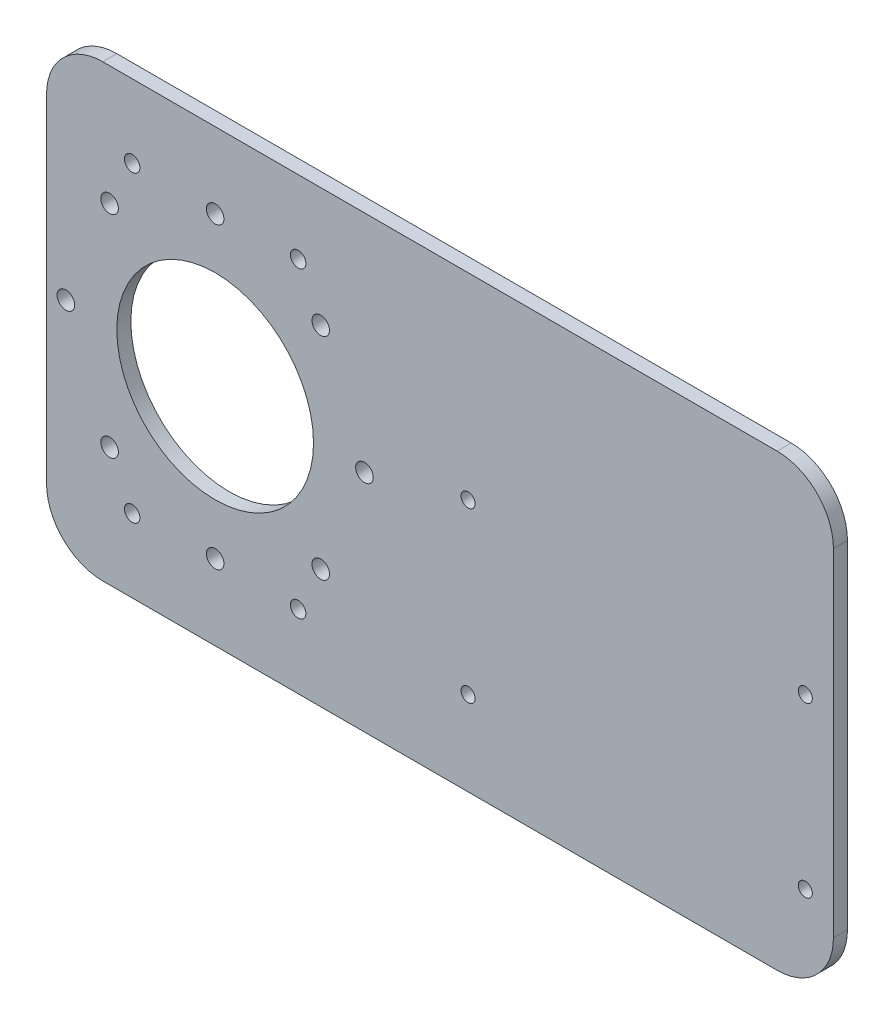
ISO-10303-21;
HEADER;
FILE_DESCRIPTION(('STEP AP214'),'2;1');
FILE_NAME('part.step','',(''),(''),'','','');
FILE_SCHEMA(('AUTOMOTIVE_DESIGN { 1 0 10303 214 1 1 1 1 }'));
ENDSEC;
DATA;
#1=APPLICATION_CONTEXT('core data for automotive mechanical design processes');
#2=APPLICATION_PROTOCOL_DEFINITION('international standard','automotive_design',2000,#1);
#3=PRODUCT_CONTEXT('',#1,'mechanical');
#4=PRODUCT('Part','Part','',(#3));
#5=PRODUCT_RELATED_PRODUCT_CATEGORY('part','',(#4));
#6=PRODUCT_DEFINITION_FORMATION('','',#4);
#7=PRODUCT_DEFINITION_CONTEXT('part definition',#1,'design');
#8=PRODUCT_DEFINITION('design','',#6,#7);
#9=PRODUCT_DEFINITION_SHAPE('','',#8);
#10=(LENGTH_UNIT() NAMED_UNIT(*) SI_UNIT(.MILLI.,.METRE.));
#11=(NAMED_UNIT(*) PLANE_ANGLE_UNIT() SI_UNIT($,.RADIAN.));
#12=(NAMED_UNIT(*) SI_UNIT($,.STERADIAN.) SOLID_ANGLE_UNIT());
#13=UNCERTAINTY_MEASURE_WITH_UNIT(LENGTH_MEASURE(1.E-05),#10,'distance_accuracy_value','');
#14=(GEOMETRIC_REPRESENTATION_CONTEXT(3) GLOBAL_UNCERTAINTY_ASSIGNED_CONTEXT((#13)) GLOBAL_UNIT_ASSIGNED_CONTEXT((#10,
#11,#12)) REPRESENTATION_CONTEXT('',''));
#15=CARTESIAN_POINT('',(0.,0.,0.));
#16=DIRECTION('',(0.,0.,1.));
#17=DIRECTION('',(1.,0.,0.));
#18=AXIS2_PLACEMENT_3D('',#15,#16,#17);
#19=CARTESIAN_POINT('',(0.,0.,6.35));
#20=DIRECTION('',(1.,0.,0.));
#21=DIRECTION('',(0.,0.,-1.));
#22=AXIS2_PLACEMENT_3D('',#19,#20,#21);
#23=PLANE('',#22);
#24=DIRECTION('',(0.,-1.,0.));
#25=VECTOR('',#24,1.);
#26=CARTESIAN_POINT('',(0.,0.,6.35));
#27=LINE('',#26,#25);
#28=CARTESIAN_POINT('',(0.,177.8,6.35));
#29=VERTEX_POINT('',#28);
#30=CARTESIAN_POINT('',(0.,25.4,6.35));
#31=VERTEX_POINT('',#30);
#32=EDGE_CURVE('E147',#29,#31,#27,.T.);
#33=ORIENTED_EDGE('',*,*,#32,.F.);
#34=DIRECTION('',(0.,0.,-1.));
#35=VECTOR('',#34,1.);
#36=CARTESIAN_POINT('',(0.,177.8,6.35));
#37=LINE('',#36,#35);
#38=CARTESIAN_POINT('',(0.,177.8,0.));
#39=VERTEX_POINT('',#38);
#40=EDGE_CURVE('E132',#29,#39,#37,.T.);
#41=ORIENTED_EDGE('',*,*,#40,.T.);
#42=DIRECTION('',(0.,-1.,0.));
#43=VECTOR('',#42,1.);
#44=CARTESIAN_POINT('',(0.,0.,0.));
#45=LINE('',#44,#43);
#46=CARTESIAN_POINT('',(0.,25.4,0.));
#47=VERTEX_POINT('',#46);
#48=EDGE_CURVE('E144',#39,#47,#45,.T.);
#49=ORIENTED_EDGE('',*,*,#48,.T.);
#50=DIRECTION('',(0.,0.,-1.));
#51=VECTOR('',#50,1.);
#52=CARTESIAN_POINT('',(0.,25.4,6.35));
#53=LINE('',#52,#51);
#54=EDGE_CURVE('E149',#47,#31,#53,.F.);
#55=ORIENTED_EDGE('',*,*,#54,.T.);
#56=EDGE_LOOP('',(#33,#41,#49,#55));
#57=FACE_BOUND('',#56,.T.);
#58=ADVANCED_FACE('F62',(#57),#23,.F.);
#59=CARTESIAN_POINT('',(0.,0.,6.35));
#60=DIRECTION('',(0.,1.,0.));
#61=DIRECTION('',(0.,0.,1.));
#62=AXIS2_PLACEMENT_3D('',#59,#60,#61);
#63=PLANE('',#62);
#64=DIRECTION('',(1.,0.,0.));
#65=VECTOR('',#64,1.);
#66=CARTESIAN_POINT('',(0.,0.,6.35));
#67=LINE('',#66,#65);
#68=CARTESIAN_POINT('',(25.4,0.,6.35));
#69=VERTEX_POINT('',#68);
#70=CARTESIAN_POINT('',(330.2,0.,6.35));
#71=VERTEX_POINT('',#70);
#72=EDGE_CURVE('E217',#69,#71,#67,.T.);
#73=ORIENTED_EDGE('',*,*,#72,.F.);
#74=DIRECTION('',(0.,0.,-1.));
#75=VECTOR('',#74,1.);
#76=CARTESIAN_POINT('',(25.4,0.,6.35));
#77=LINE('',#76,#75);
#78=CARTESIAN_POINT('',(25.4,0.,0.));
#79=VERTEX_POINT('',#78);
#80=EDGE_CURVE('E210',#69,#79,#77,.T.);
#81=ORIENTED_EDGE('',*,*,#80,.T.);
#82=DIRECTION('',(1.,0.,0.));
#83=VECTOR('',#82,1.);
#84=CARTESIAN_POINT('',(0.,0.,0.));
#85=LINE('',#84,#83);
#86=CARTESIAN_POINT('',(330.2,0.,0.));
#87=VERTEX_POINT('',#86);
#88=EDGE_CURVE('E153',#79,#87,#85,.T.);
#89=ORIENTED_EDGE('',*,*,#88,.T.);
#90=DIRECTION('',(0.,0.,-1.));
#91=VECTOR('',#90,1.);
#92=CARTESIAN_POINT('',(330.2,0.,6.35));
#93=LINE('',#92,#91);
#94=EDGE_CURVE('E208',#87,#71,#93,.F.);
#95=ORIENTED_EDGE('',*,*,#94,.T.);
#96=EDGE_LOOP('',(#73,#81,#89,#95));
#97=FACE_BOUND('',#96,.T.);
#98=ADVANCED_FACE('F215',(#97),#63,.F.);
#99=CARTESIAN_POINT('',(355.6,0.,6.35));
#100=DIRECTION('',(-1.,0.,0.));
#101=DIRECTION('',(0.,0.,1.));
#102=AXIS2_PLACEMENT_3D('',#99,#100,#101);
#103=PLANE('',#102);
#104=DIRECTION('',(0.,1.,0.));
#105=VECTOR('',#104,1.);
#106=CARTESIAN_POINT('',(355.6,0.,6.35));
#107=LINE('',#106,#105);
#108=CARTESIAN_POINT('',(355.6,25.4,6.35));
#109=VERTEX_POINT('',#108);
#110=CARTESIAN_POINT('',(355.6,177.8,6.35));
#111=VERTEX_POINT('',#110);
#112=EDGE_CURVE('E225',#109,#111,#107,.T.);
#113=ORIENTED_EDGE('',*,*,#112,.F.);
#114=DIRECTION('',(0.,0.,-1.));
#115=VECTOR('',#114,1.);
#116=CARTESIAN_POINT('',(355.6,25.4,6.35));
#117=LINE('',#116,#115);
#118=CARTESIAN_POINT('',(355.6,25.4,0.));
#119=VERTEX_POINT('',#118);
#120=EDGE_CURVE('E12',#109,#119,#117,.T.);
#121=ORIENTED_EDGE('',*,*,#120,.T.);
#122=DIRECTION('',(0.,1.,0.));
#123=VECTOR('',#122,1.);
#124=CARTESIAN_POINT('',(355.6,0.,0.));
#125=LINE('',#124,#123);
#126=CARTESIAN_POINT('',(355.6,177.8,0.));
#127=VERTEX_POINT('',#126);
#128=EDGE_CURVE('E157',#119,#127,#125,.T.);
#129=ORIENTED_EDGE('',*,*,#128,.T.);
#130=DIRECTION('',(0.,0.,-1.));
#131=VECTOR('',#130,1.);
#132=CARTESIAN_POINT('',(355.6,177.8,6.35));
#133=LINE('',#132,#131);
#134=EDGE_CURVE('E70',#127,#111,#133,.F.);
#135=ORIENTED_EDGE('',*,*,#134,.T.);
#136=EDGE_LOOP('',(#113,#121,#129,#135));
#137=FACE_BOUND('',#136,.T.);
#138=ADVANCED_FACE('F224',(#137),#103,.F.);
#139=CARTESIAN_POINT('',(0.,203.2,6.35));
#140=DIRECTION('',(0.,-1.,0.));
#141=DIRECTION('',(0.,0.,-1.));
#142=AXIS2_PLACEMENT_3D('',#139,#140,#141);
#143=PLANE('',#142);
#144=DIRECTION('',(-1.,0.,0.));
#145=VECTOR('',#144,1.);
#146=CARTESIAN_POINT('',(0.,203.2,0.));
#147=LINE('',#146,#145);
#148=CARTESIAN_POINT('',(330.2,203.2,0.));
#149=VERTEX_POINT('',#148);
#150=CARTESIAN_POINT('',(25.4,203.2,0.));
#151=VERTEX_POINT('',#150);
#152=EDGE_CURVE('E167',#149,#151,#147,.T.);
#153=ORIENTED_EDGE('',*,*,#152,.T.);
#154=DIRECTION('',(0.,0.,-1.));
#155=VECTOR('',#154,1.);
#156=CARTESIAN_POINT('',(25.4,203.2,6.35));
#157=LINE('',#156,#155);
#158=CARTESIAN_POINT('',(25.4,203.2,6.35));
#159=VERTEX_POINT('',#158);
#160=EDGE_CURVE('E133',#151,#159,#157,.F.);
#161=ORIENTED_EDGE('',*,*,#160,.T.);
#162=DIRECTION('',(-1.,0.,0.));
#163=VECTOR('',#162,1.);
#164=CARTESIAN_POINT('',(0.,203.2,6.35));
#165=LINE('',#164,#163);
#166=CARTESIAN_POINT('',(330.2,203.2,6.35));
#167=VERTEX_POINT('',#166);
#168=EDGE_CURVE('E163',#167,#159,#165,.T.);
#169=ORIENTED_EDGE('',*,*,#168,.F.);
#170=DIRECTION('',(0.,0.,-1.));
#171=VECTOR('',#170,1.);
#172=CARTESIAN_POINT('',(330.2,203.2,6.35));
#173=LINE('',#172,#171);
#174=EDGE_CURVE('E138',#167,#149,#173,.T.);
#175=ORIENTED_EDGE('',*,*,#174,.T.);
#176=EDGE_LOOP('',(#153,#161,#169,#175));
#177=FACE_BOUND('',#176,.T.);
#178=ADVANCED_FACE('F357',(#177),#143,.F.);
#179=CARTESIAN_POINT('',(0.,0.,6.35));
#180=DIRECTION('',(0.,0.,-1.));
#181=DIRECTION('',(-1.,0.,0.));
#182=AXIS2_PLACEMENT_3D('',#179,#180,#181);
#183=PLANE('',#182);
#184=CARTESIAN_POINT('',(342.9,38.1,6.35));
#185=DIRECTION('',(0.,0.,-1.));
#186=DIRECTION('',(1.,0.,0.));
#187=AXIS2_PLACEMENT_3D('',#184,#185,#186);
#188=CIRCLE('',#187,3.17499999999997);
#189=CARTESIAN_POINT('',(346.075,38.1,6.35));
#190=VERTEX_POINT('',#189);
#191=EDGE_CURVE('E291',#190,#190,#188,.T.);
#192=ORIENTED_EDGE('',*,*,#191,.T.);
#193=EDGE_LOOP('',(#192));
#194=FACE_BOUND('',#193,.T.);
#195=CARTESIAN_POINT('',(190.5,38.1,6.35));
#196=DIRECTION('',(0.,0.,-1.));
#197=DIRECTION('',(1.,0.,0.));
#198=AXIS2_PLACEMENT_3D('',#195,#196,#197);
#199=CIRCLE('',#198,3.17500000000003);
#200=CARTESIAN_POINT('',(193.675,38.1,6.35));
#201=VERTEX_POINT('',#200);
#202=EDGE_CURVE('E297',#201,#201,#199,.T.);
#203=ORIENTED_EDGE('',*,*,#202,.T.);
#204=EDGE_LOOP('',(#203));
#205=FACE_BOUND('',#204,.T.);
#206=CARTESIAN_POINT('',(190.5,114.3,6.35));
#207=DIRECTION('',(0.,0.,-1.));
#208=DIRECTION('',(-1.,0.,0.));
#209=AXIS2_PLACEMENT_3D('',#206,#207,#208);
#210=CIRCLE('',#209,3.17500000000003);
#211=CARTESIAN_POINT('',(187.325,114.3,6.35));
#212=VERTEX_POINT('',#211);
#213=EDGE_CURVE('E285',#212,#212,#210,.T.);
#214=ORIENTED_EDGE('',*,*,#213,.T.);
#215=EDGE_LOOP('',(#214));
#216=FACE_BOUND('',#215,.T.);
#217=CARTESIAN_POINT('',(342.9,114.3,6.35));
#218=DIRECTION('',(0.,0.,-1.));
#219=DIRECTION('',(-1.,0.,0.));
#220=AXIS2_PLACEMENT_3D('',#217,#218,#219);
#221=CIRCLE('',#220,3.17499999999997);
#222=CARTESIAN_POINT('',(339.725,114.3,6.35));
#223=VERTEX_POINT('',#222);
#224=EDGE_CURVE('E268',#223,#223,#221,.T.);
#225=ORIENTED_EDGE('',*,*,#224,.T.);
#226=EDGE_LOOP('',(#225));
#227=FACE_BOUND('',#226,.T.);
#228=CARTESIAN_POINT('',(38.69944,33.10001,6.35));
#229=DIRECTION('',(0.,0.,1.));
#230=DIRECTION('',(1.,0.,0.));
#231=AXIS2_PLACEMENT_3D('',#228,#229,#230);
#232=CIRCLE('',#231,3.50012);
#233=CARTESIAN_POINT('',(42.19956,33.10001,6.35));
#234=VERTEX_POINT('',#233);
#235=EDGE_CURVE('E264',#234,#234,#232,.T.);
#236=ORIENTED_EDGE('',*,*,#235,.F.);
#237=EDGE_LOOP('',(#236));
#238=FACE_BOUND('',#237,.T.);
#239=CARTESIAN_POINT('',(113.70056,33.10001,6.35));
#240=DIRECTION('',(0.,0.,1.));
#241=DIRECTION('',(1.,0.,0.));
#242=AXIS2_PLACEMENT_3D('',#239,#240,#241);
#243=CIRCLE('',#242,3.50012000000002);
#244=CARTESIAN_POINT('',(117.20068,33.10001,6.35));
#245=VERTEX_POINT('',#244);
#246=EDGE_CURVE('E271',#245,#245,#243,.T.);
#247=ORIENTED_EDGE('',*,*,#246,.F.);
#248=EDGE_LOOP('',(#247));
#249=FACE_BOUND('',#248,.T.);
#250=CARTESIAN_POINT('',(113.70056,170.09999,6.35));
#251=DIRECTION('',(0.,0.,1.));
#252=DIRECTION('',(1.,0.,0.));
#253=AXIS2_PLACEMENT_3D('',#250,#251,#252);
#254=CIRCLE('',#253,3.50011999999997);
#255=CARTESIAN_POINT('',(117.20068,170.09999,6.35));
#256=VERTEX_POINT('',#255);
#257=EDGE_CURVE('E277',#256,#256,#254,.T.);
#258=ORIENTED_EDGE('',*,*,#257,.F.);
#259=EDGE_LOOP('',(#258));
#260=FACE_BOUND('',#259,.T.);
#261=CARTESIAN_POINT('',(38.69944,170.09999,6.35));
#262=DIRECTION('',(0.,0.,1.));
#263=DIRECTION('',(1.,0.,0.));
#264=AXIS2_PLACEMENT_3D('',#261,#262,#263);
#265=CIRCLE('',#264,3.50012);
#266=CARTESIAN_POINT('',(42.19956,170.09999,6.35));
#267=VERTEX_POINT('',#266);
#268=EDGE_CURVE('E258',#267,#267,#265,.T.);
#269=ORIENTED_EDGE('',*,*,#268,.F.);
#270=EDGE_LOOP('',(#269));
#271=FACE_BOUND('',#270,.T.);
#272=CARTESIAN_POINT('',(143.66875,101.6,6.35));
#273=DIRECTION('',(0.,0.,1.));
#274=DIRECTION('',(1.,0.,0.));
#275=AXIS2_PLACEMENT_3D('',#272,#273,#274);
#276=CIRCLE('',#275,3.96874999999999);
#277=CARTESIAN_POINT('',(147.6375,101.6,6.35));
#278=VERTEX_POINT('',#277);
#279=EDGE_CURVE('E173',#278,#278,#276,.T.);
#280=ORIENTED_EDGE('',*,*,#279,.F.);
#281=EDGE_LOOP('',(#280));
#282=FACE_BOUND('',#281,.T.);
#283=CARTESIAN_POINT('',(76.2000000000007,34.131249999999,6.35));
#284=DIRECTION('',(0.,0.,1.));
#285=DIRECTION('',(1.,0.,0.));
#286=AXIS2_PLACEMENT_3D('',#283,#284,#285);
#287=CIRCLE('',#286,3.96874999999999);
#288=CARTESIAN_POINT('',(80.1687500000007,34.131249999999,6.35));
#289=VERTEX_POINT('',#288);
#290=EDGE_CURVE('E241',#289,#289,#287,.T.);
#291=ORIENTED_EDGE('',*,*,#290,.F.);
#292=EDGE_LOOP('',(#291));
#293=FACE_BOUND('',#292,.T.);
#294=CARTESIAN_POINT('',(28.4923893568198,149.307610643179,6.35));
#295=DIRECTION('',(0.,0.,1.));
#296=DIRECTION('',(1.,0.,0.));
#297=AXIS2_PLACEMENT_3D('',#294,#295,#296);
#298=CIRCLE('',#297,3.96875);
#299=CARTESIAN_POINT('',(32.4611393568198,149.307610643179,6.35));
#300=VERTEX_POINT('',#299);
#301=EDGE_CURVE('E244',#300,#300,#298,.T.);
#302=ORIENTED_EDGE('',*,*,#301,.F.);
#303=EDGE_LOOP('',(#302));
#304=FACE_BOUND('',#303,.T.);
#305=CARTESIAN_POINT('',(76.1999999999997,169.068749999999,6.35));
#306=DIRECTION('',(0.,0.,1.));
#307=DIRECTION('',(1.,0.,0.));
#308=AXIS2_PLACEMENT_3D('',#305,#306,#307);
#309=CIRCLE('',#308,3.96874999999998);
#310=CARTESIAN_POINT('',(80.1687499999997,169.068749999999,6.35));
#311=VERTEX_POINT('',#310);
#312=EDGE_CURVE('E247',#311,#311,#309,.T.);
#313=ORIENTED_EDGE('',*,*,#312,.F.);
#314=EDGE_LOOP('',(#313));
#315=FACE_BOUND('',#314,.T.);
#316=CARTESIAN_POINT('',(123.90761064318,149.307610643179,6.35));
#317=DIRECTION('',(0.,0.,1.));
#318=DIRECTION('',(1.,0.,0.));
#319=AXIS2_PLACEMENT_3D('',#316,#317,#318);
#320=CIRCLE('',#319,3.96875);
#321=CARTESIAN_POINT('',(127.87636064318,149.307610643179,6.35));
#322=VERTEX_POINT('',#321);
#323=EDGE_CURVE('E250',#322,#322,#320,.T.);
#324=ORIENTED_EDGE('',*,*,#323,.F.);
#325=EDGE_LOOP('',(#324));
#326=FACE_BOUND('',#325,.T.);
#327=CARTESIAN_POINT('',(123.907610643181,53.8923893568198,6.35));
#328=DIRECTION('',(0.,0.,1.));
#329=DIRECTION('',(1.,0.,0.));
#330=AXIS2_PLACEMENT_3D('',#327,#328,#329);
#331=CIRCLE('',#330,3.96874999999999);
#332=CARTESIAN_POINT('',(127.876360643181,53.8923893568198,6.35));
#333=VERTEX_POINT('',#332);
#334=EDGE_CURVE('E234',#333,#333,#331,.T.);
#335=ORIENTED_EDGE('',*,*,#334,.F.);
#336=EDGE_LOOP('',(#335));
#337=FACE_BOUND('',#336,.T.);
#338=CARTESIAN_POINT('',(76.2,101.6,6.35));
#339=DIRECTION('',(0.,0.,1.));
#340=DIRECTION('',(1.,0.,0.));
#341=AXIS2_PLACEMENT_3D('',#338,#339,#340);
#342=CIRCLE('',#341,44.45);
#343=CARTESIAN_POINT('',(120.65,101.6,6.35));
#344=VERTEX_POINT('',#343);
#345=EDGE_CURVE('E231',#344,#344,#342,.T.);
#346=ORIENTED_EDGE('',*,*,#345,.F.);
#347=EDGE_LOOP('',(#346));
#348=FACE_BOUND('',#347,.T.);
#349=CARTESIAN_POINT('',(28.4923893568205,53.8923893568186,6.35));
#350=DIRECTION('',(0.,0.,1.));
#351=DIRECTION('',(1.,0.,0.));
#352=AXIS2_PLACEMENT_3D('',#349,#350,#351);
#353=CIRCLE('',#352,3.96874999999999);
#354=CARTESIAN_POINT('',(32.4611393568205,53.8923893568186,6.35));
#355=VERTEX_POINT('',#354);
#356=EDGE_CURVE('E237',#355,#355,#353,.T.);
#357=ORIENTED_EDGE('',*,*,#356,.F.);
#358=EDGE_LOOP('',(#357));
#359=FACE_BOUND('',#358,.T.);
#360=CARTESIAN_POINT('',(8.73124999999997,101.599999999999,6.35));
#361=DIRECTION('',(0.,0.,1.));
#362=DIRECTION('',(1.,0.,0.));
#363=AXIS2_PLACEMENT_3D('',#360,#361,#362);
#364=CIRCLE('',#363,3.96874999999998);
#365=CARTESIAN_POINT('',(12.7,101.599999999999,6.35));
#366=VERTEX_POINT('',#365);
#367=EDGE_CURVE('E238',#366,#366,#364,.T.);
#368=ORIENTED_EDGE('',*,*,#367,.F.);
#369=EDGE_LOOP('',(#368));
#370=FACE_BOUND('',#369,.T.);
#371=ORIENTED_EDGE('',*,*,#168,.T.);
#372=CARTESIAN_POINT('',(25.4,177.8,6.35));
#373=DIRECTION('',(0.,0.,-1.));
#374=DIRECTION('',(-1.,0.,0.));
#375=AXIS2_PLACEMENT_3D('',#372,#373,#374);
#376=CIRCLE('',#375,25.4);
#377=EDGE_CURVE('E206',#159,#29,#376,.F.);
#378=ORIENTED_EDGE('',*,*,#377,.T.);
#379=ORIENTED_EDGE('',*,*,#32,.T.);
#380=CARTESIAN_POINT('',(25.4,25.4,6.35));
#381=DIRECTION('',(0.,0.,-1.));
#382=DIRECTION('',(-1.,0.,0.));
#383=AXIS2_PLACEMENT_3D('',#380,#381,#382);
#384=CIRCLE('',#383,25.4);
#385=EDGE_CURVE('E204',#31,#69,#384,.F.);
#386=ORIENTED_EDGE('',*,*,#385,.T.);
#387=ORIENTED_EDGE('',*,*,#72,.T.);
#388=CARTESIAN_POINT('',(330.2,25.4,6.35));
#389=DIRECTION('',(0.,0.,-1.));
#390=DIRECTION('',(-1.,0.,0.));
#391=AXIS2_PLACEMENT_3D('',#388,#389,#390);
#392=CIRCLE('',#391,25.4);
#393=EDGE_CURVE('E83',#71,#109,#392,.F.);
#394=ORIENTED_EDGE('',*,*,#393,.T.);
#395=ORIENTED_EDGE('',*,*,#112,.T.);
#396=CARTESIAN_POINT('',(330.2,177.8,6.35));
#397=DIRECTION('',(0.,0.,-1.));
#398=DIRECTION('',(-1.,0.,0.));
#399=AXIS2_PLACEMENT_3D('',#396,#397,#398);
#400=CIRCLE('',#399,25.4);
#401=EDGE_CURVE('E201',#111,#167,#400,.F.);
#402=ORIENTED_EDGE('',*,*,#401,.T.);
#403=EDGE_LOOP('',(#371,#378,#379,#386,#387,#394,#395,#402));
#404=FACE_BOUND('',#403,.T.);
#405=ADVANCED_FACE('F306',(#194,#205,#216,#227,#238,#249,#260,#271,#282,#293,#304,#315,#326,
#337,#348,#359,#370,#404),#183,.F.);
#406=CARTESIAN_POINT('',(0.,0.,0.));
#407=DIRECTION('',(0.,0.,-1.));
#408=DIRECTION('',(-1.,0.,0.));
#409=AXIS2_PLACEMENT_3D('',#406,#407,#408);
#410=PLANE('',#409);
#411=CARTESIAN_POINT('',(342.9,38.1,0.));
#412=DIRECTION('',(0.,0.,-1.));
#413=DIRECTION('',(1.,0.,0.));
#414=AXIS2_PLACEMENT_3D('',#411,#412,#413);
#415=CIRCLE('',#414,3.17499999999997);
#416=CARTESIAN_POINT('',(346.075,38.1,0.));
#417=VERTEX_POINT('',#416);
#418=EDGE_CURVE('E288',#417,#417,#415,.T.);
#419=ORIENTED_EDGE('',*,*,#418,.F.);
#420=EDGE_LOOP('',(#419));
#421=FACE_BOUND('',#420,.T.);
#422=CARTESIAN_POINT('',(190.5,38.1,0.));
#423=DIRECTION('',(0.,0.,-1.));
#424=DIRECTION('',(1.,0.,0.));
#425=AXIS2_PLACEMENT_3D('',#422,#423,#424);
#426=CIRCLE('',#425,3.17500000000003);
#427=CARTESIAN_POINT('',(193.675,38.1,0.));
#428=VERTEX_POINT('',#427);
#429=EDGE_CURVE('E294',#428,#428,#426,.T.);
#430=ORIENTED_EDGE('',*,*,#429,.F.);
#431=EDGE_LOOP('',(#430));
#432=FACE_BOUND('',#431,.T.);
#433=CARTESIAN_POINT('',(190.5,114.3,0.));
#434=DIRECTION('',(0.,0.,-1.));
#435=DIRECTION('',(-1.,0.,0.));
#436=AXIS2_PLACEMENT_3D('',#433,#434,#435);
#437=CIRCLE('',#436,3.17500000000003);
#438=CARTESIAN_POINT('',(187.325,114.3,0.));
#439=VERTEX_POINT('',#438);
#440=EDGE_CURVE('E300',#439,#439,#437,.T.);
#441=ORIENTED_EDGE('',*,*,#440,.F.);
#442=EDGE_LOOP('',(#441));
#443=FACE_BOUND('',#442,.T.);
#444=CARTESIAN_POINT('',(342.9,114.3,0.));
#445=DIRECTION('',(0.,0.,-1.));
#446=DIRECTION('',(-1.,0.,0.));
#447=AXIS2_PLACEMENT_3D('',#444,#445,#446);
#448=CIRCLE('',#447,3.17499999999997);
#449=CARTESIAN_POINT('',(339.725,114.3,0.));
#450=VERTEX_POINT('',#449);
#451=EDGE_CURVE('E282',#450,#450,#448,.T.);
#452=ORIENTED_EDGE('',*,*,#451,.F.);
#453=EDGE_LOOP('',(#452));
#454=FACE_BOUND('',#453,.T.);
#455=CARTESIAN_POINT('',(38.69944,33.10001,0.));
#456=DIRECTION('',(0.,0.,1.));
#457=DIRECTION('',(1.,0.,0.));
#458=AXIS2_PLACEMENT_3D('',#455,#456,#457);
#459=CIRCLE('',#458,3.50012);
#460=CARTESIAN_POINT('',(42.19956,33.10001,0.));
#461=VERTEX_POINT('',#460);
#462=EDGE_CURVE('E267',#461,#461,#459,.T.);
#463=ORIENTED_EDGE('',*,*,#462,.T.);
#464=EDGE_LOOP('',(#463));
#465=FACE_BOUND('',#464,.T.);
#466=CARTESIAN_POINT('',(113.70056,33.10001,0.));
#467=DIRECTION('',(0.,0.,1.));
#468=DIRECTION('',(1.,0.,0.));
#469=AXIS2_PLACEMENT_3D('',#466,#467,#468);
#470=CIRCLE('',#469,3.50012000000002);
#471=CARTESIAN_POINT('',(117.20068,33.10001,0.));
#472=VERTEX_POINT('',#471);
#473=EDGE_CURVE('E274',#472,#472,#470,.T.);
#474=ORIENTED_EDGE('',*,*,#473,.T.);
#475=EDGE_LOOP('',(#474));
#476=FACE_BOUND('',#475,.T.);
#477=CARTESIAN_POINT('',(113.70056,170.09999,0.));
#478=DIRECTION('',(0.,0.,1.));
#479=DIRECTION('',(1.,0.,0.));
#480=AXIS2_PLACEMENT_3D('',#477,#478,#479);
#481=CIRCLE('',#480,3.50011999999997);
#482=CARTESIAN_POINT('',(117.20068,170.09999,0.));
#483=VERTEX_POINT('',#482);
#484=EDGE_CURVE('E261',#483,#483,#481,.T.);
#485=ORIENTED_EDGE('',*,*,#484,.T.);
#486=EDGE_LOOP('',(#485));
#487=FACE_BOUND('',#486,.T.);
#488=CARTESIAN_POINT('',(38.69944,170.09999,0.));
#489=DIRECTION('',(0.,0.,1.));
#490=DIRECTION('',(1.,0.,0.));
#491=AXIS2_PLACEMENT_3D('',#488,#489,#490);
#492=CIRCLE('',#491,3.50012);
#493=CARTESIAN_POINT('',(42.19956,170.09999,0.));
#494=VERTEX_POINT('',#493);
#495=EDGE_CURVE('E253',#494,#494,#492,.T.);
#496=ORIENTED_EDGE('',*,*,#495,.T.);
#497=EDGE_LOOP('',(#496));
#498=FACE_BOUND('',#497,.T.);
#499=CARTESIAN_POINT('',(143.66875,101.6,0.));
#500=DIRECTION('',(0.,0.,-1.));
#501=DIRECTION('',(-1.,0.,0.));
#502=AXIS2_PLACEMENT_3D('',#499,#500,#501);
#503=CIRCLE('',#502,3.96874999999999);
#504=CARTESIAN_POINT('',(139.7,101.6,0.));
#505=VERTEX_POINT('',#504);
#506=EDGE_CURVE('E154',#505,#505,#503,.T.);
#507=ORIENTED_EDGE('',*,*,#506,.F.);
#508=EDGE_LOOP('',(#507));
#509=FACE_BOUND('',#508,.T.);
#510=CARTESIAN_POINT('',(76.2000000000007,34.131249999999,0.));
#511=DIRECTION('',(0.,0.,-1.));
#512=DIRECTION('',(-1.,0.,0.));
#513=AXIS2_PLACEMENT_3D('',#510,#511,#512);
#514=CIRCLE('',#513,3.96874999999999);
#515=CARTESIAN_POINT('',(72.2312500000008,34.131249999999,0.));
#516=VERTEX_POINT('',#515);
#517=EDGE_CURVE('E160',#516,#516,#514,.T.);
#518=ORIENTED_EDGE('',*,*,#517,.F.);
#519=EDGE_LOOP('',(#518));
#520=FACE_BOUND('',#519,.T.);
#521=CARTESIAN_POINT('',(28.4923893568198,149.307610643179,0.));
#522=DIRECTION('',(0.,0.,-1.));
#523=DIRECTION('',(-1.,0.,0.));
#524=AXIS2_PLACEMENT_3D('',#521,#522,#523);
#525=CIRCLE('',#524,3.96875);
#526=CARTESIAN_POINT('',(24.5236393568198,149.307610643179,0.));
#527=VERTEX_POINT('',#526);
#528=EDGE_CURVE('E188',#527,#527,#525,.T.);
#529=ORIENTED_EDGE('',*,*,#528,.F.);
#530=EDGE_LOOP('',(#529));
#531=FACE_BOUND('',#530,.T.);
#532=CARTESIAN_POINT('',(76.1999999999997,169.068749999999,0.));
#533=DIRECTION('',(0.,0.,-1.));
#534=DIRECTION('',(-1.,0.,0.));
#535=AXIS2_PLACEMENT_3D('',#532,#533,#534);
#536=CIRCLE('',#535,3.96874999999998);
#537=CARTESIAN_POINT('',(72.2312499999997,169.068749999999,0.));
#538=VERTEX_POINT('',#537);
#539=EDGE_CURVE('E185',#538,#538,#536,.T.);
#540=ORIENTED_EDGE('',*,*,#539,.F.);
#541=EDGE_LOOP('',(#540));
#542=FACE_BOUND('',#541,.T.);
#543=CARTESIAN_POINT('',(123.90761064318,149.307610643179,0.));
#544=DIRECTION('',(0.,0.,-1.));
#545=DIRECTION('',(-1.,0.,0.));
#546=AXIS2_PLACEMENT_3D('',#543,#544,#545);
#547=CIRCLE('',#546,3.96875);
#548=CARTESIAN_POINT('',(119.93886064318,149.307610643179,0.));
#549=VERTEX_POINT('',#548);
#550=EDGE_CURVE('E182',#549,#549,#547,.T.);
#551=ORIENTED_EDGE('',*,*,#550,.F.);
#552=EDGE_LOOP('',(#551));
#553=FACE_BOUND('',#552,.T.);
#554=CARTESIAN_POINT('',(123.907610643181,53.8923893568198,0.));
#555=DIRECTION('',(0.,0.,-1.));
#556=DIRECTION('',(-1.,0.,0.));
#557=AXIS2_PLACEMENT_3D('',#554,#555,#556);
#558=CIRCLE('',#557,3.96874999999999);
#559=CARTESIAN_POINT('',(119.938860643181,53.8923893568198,0.));
#560=VERTEX_POINT('',#559);
#561=EDGE_CURVE('E179',#560,#560,#558,.T.);
#562=ORIENTED_EDGE('',*,*,#561,.F.);
#563=EDGE_LOOP('',(#562));
#564=FACE_BOUND('',#563,.T.);
#565=CARTESIAN_POINT('',(76.2,101.6,0.));
#566=DIRECTION('',(0.,0.,-1.));
#567=DIRECTION('',(-1.,0.,0.));
#568=AXIS2_PLACEMENT_3D('',#565,#566,#567);
#569=CIRCLE('',#568,44.45);
#570=CARTESIAN_POINT('',(31.75,101.6,0.));
#571=VERTEX_POINT('',#570);
#572=EDGE_CURVE('E176',#571,#571,#569,.T.);
#573=ORIENTED_EDGE('',*,*,#572,.F.);
#574=EDGE_LOOP('',(#573));
#575=FACE_BOUND('',#574,.T.);
#576=CARTESIAN_POINT('',(28.4923893568205,53.8923893568186,0.));
#577=DIRECTION('',(0.,0.,-1.));
#578=DIRECTION('',(-1.,0.,0.));
#579=AXIS2_PLACEMENT_3D('',#576,#577,#578);
#580=CIRCLE('',#579,3.96874999999999);
#581=CARTESIAN_POINT('',(24.5236393568205,53.8923893568186,0.));
#582=VERTEX_POINT('',#581);
#583=EDGE_CURVE('E172',#582,#582,#580,.T.);
#584=ORIENTED_EDGE('',*,*,#583,.F.);
#585=EDGE_LOOP('',(#584));
#586=FACE_BOUND('',#585,.T.);
#587=CARTESIAN_POINT('',(8.73124999999997,101.599999999999,0.));
#588=DIRECTION('',(0.,0.,-1.));
#589=DIRECTION('',(-1.,0.,0.));
#590=AXIS2_PLACEMENT_3D('',#587,#588,#589);
#591=CIRCLE('',#590,3.96874999999998);
#592=CARTESIAN_POINT('',(4.76249999999999,101.599999999999,0.));
#593=VERTEX_POINT('',#592);
#594=EDGE_CURVE('E169',#593,#593,#591,.T.);
#595=ORIENTED_EDGE('',*,*,#594,.F.);
#596=EDGE_LOOP('',(#595));
#597=FACE_BOUND('',#596,.T.);
#598=ORIENTED_EDGE('',*,*,#48,.F.);
#599=CARTESIAN_POINT('',(25.4,177.8,0.));
#600=DIRECTION('',(0.,0.,-1.));
#601=DIRECTION('',(-1.,0.,0.));
#602=AXIS2_PLACEMENT_3D('',#599,#600,#601);
#603=CIRCLE('',#602,25.4);
#604=EDGE_CURVE('E128',#39,#151,#603,.T.);
#605=ORIENTED_EDGE('',*,*,#604,.T.);
#606=ORIENTED_EDGE('',*,*,#152,.F.);
#607=CARTESIAN_POINT('',(330.2,177.8,0.));
#608=DIRECTION('',(0.,0.,-1.));
#609=DIRECTION('',(-1.,0.,0.));
#610=AXIS2_PLACEMENT_3D('',#607,#608,#609);
#611=CIRCLE('',#610,25.4);
#612=EDGE_CURVE('E148',#149,#127,#611,.T.);
#613=ORIENTED_EDGE('',*,*,#612,.T.);
#614=ORIENTED_EDGE('',*,*,#128,.F.);
#615=CARTESIAN_POINT('',(330.2,25.4,0.));
#616=DIRECTION('',(0.,0.,-1.));
#617=DIRECTION('',(-1.,0.,0.));
#618=AXIS2_PLACEMENT_3D('',#615,#616,#617);
#619=CIRCLE('',#618,25.4);
#620=EDGE_CURVE('E195',#119,#87,#619,.T.);
#621=ORIENTED_EDGE('',*,*,#620,.T.);
#622=ORIENTED_EDGE('',*,*,#88,.F.);
#623=CARTESIAN_POINT('',(25.4,25.4,0.));
#624=DIRECTION('',(0.,0.,-1.));
#625=DIRECTION('',(-1.,0.,0.));
#626=AXIS2_PLACEMENT_3D('',#623,#624,#625);
#627=CIRCLE('',#626,25.4);
#628=EDGE_CURVE('E139',#79,#47,#627,.T.);
#629=ORIENTED_EDGE('',*,*,#628,.T.);
#630=EDGE_LOOP('',(#598,#605,#606,#613,#614,#621,#622,#629));
#631=FACE_BOUND('',#630,.T.);
#632=ADVANCED_FACE('F151',(#421,#432,#443,#454,#465,#476,#487,#498,#509,#520,#531,#542,#553,
#564,#575,#586,#597,#631),#410,.T.);
#633=CARTESIAN_POINT('',(8.73124999999997,101.599999999999,-69.85));
#634=DIRECTION('',(0.,0.,1.));
#635=DIRECTION('',(1.,0.,0.));
#636=AXIS2_PLACEMENT_3D('',#633,#634,#635);
#637=CYLINDRICAL_SURFACE('',#636,3.96874999999998);
#638=ORIENTED_EDGE('',*,*,#594,.T.);
#639=EDGE_LOOP('',(#638));
#640=FACE_BOUND('',#639,.T.);
#641=ORIENTED_EDGE('',*,*,#367,.T.);
#642=EDGE_LOOP('',(#641));
#643=FACE_BOUND('',#642,.T.);
#644=ADVANCED_FACE('F319',(#640,#643),#637,.F.);
#645=CARTESIAN_POINT('',(28.4923893568205,53.8923893568186,-69.85));
#646=DIRECTION('',(0.,0.,1.));
#647=DIRECTION('',(1.,0.,0.));
#648=AXIS2_PLACEMENT_3D('',#645,#646,#647);
#649=CYLINDRICAL_SURFACE('',#648,3.96874999999999);
#650=ORIENTED_EDGE('',*,*,#583,.T.);
#651=EDGE_LOOP('',(#650));
#652=FACE_BOUND('',#651,.T.);
#653=ORIENTED_EDGE('',*,*,#356,.T.);
#654=EDGE_LOOP('',(#653));
#655=FACE_BOUND('',#654,.T.);
#656=ADVANCED_FACE('F352',(#652,#655),#649,.F.);
#657=CARTESIAN_POINT('',(76.2,101.6,-69.85));
#658=DIRECTION('',(0.,0.,1.));
#659=DIRECTION('',(1.,0.,0.));
#660=AXIS2_PLACEMENT_3D('',#657,#658,#659);
#661=CYLINDRICAL_SURFACE('',#660,44.45);
#662=ORIENTED_EDGE('',*,*,#572,.T.);
#663=EDGE_LOOP('',(#662));
#664=FACE_BOUND('',#663,.T.);
#665=ORIENTED_EDGE('',*,*,#345,.T.);
#666=EDGE_LOOP('',(#665));
#667=FACE_BOUND('',#666,.T.);
#668=ADVANCED_FACE('F486',(#664,#667),#661,.F.);
#669=CARTESIAN_POINT('',(123.907610643181,53.8923893568198,-69.85));
#670=DIRECTION('',(0.,0.,1.));
#671=DIRECTION('',(1.,0.,0.));
#672=AXIS2_PLACEMENT_3D('',#669,#670,#671);
#673=CYLINDRICAL_SURFACE('',#672,3.96874999999999);
#674=ORIENTED_EDGE('',*,*,#561,.T.);
#675=EDGE_LOOP('',(#674));
#676=FACE_BOUND('',#675,.T.);
#677=ORIENTED_EDGE('',*,*,#334,.T.);
#678=EDGE_LOOP('',(#677));
#679=FACE_BOUND('',#678,.T.);
#680=ADVANCED_FACE('F477',(#676,#679),#673,.F.);
#681=CARTESIAN_POINT('',(123.90761064318,149.307610643179,-69.85));
#682=DIRECTION('',(0.,0.,1.));
#683=DIRECTION('',(1.,0.,0.));
#684=AXIS2_PLACEMENT_3D('',#681,#682,#683);
#685=CYLINDRICAL_SURFACE('',#684,3.96875);
#686=ORIENTED_EDGE('',*,*,#550,.T.);
#687=EDGE_LOOP('',(#686));
#688=FACE_BOUND('',#687,.T.);
#689=ORIENTED_EDGE('',*,*,#323,.T.);
#690=EDGE_LOOP('',(#689));
#691=FACE_BOUND('',#690,.T.);
#692=ADVANCED_FACE('F473',(#688,#691),#685,.F.);
#693=CARTESIAN_POINT('',(76.1999999999997,169.068749999999,-69.85));
#694=DIRECTION('',(0.,0.,1.));
#695=DIRECTION('',(1.,0.,0.));
#696=AXIS2_PLACEMENT_3D('',#693,#694,#695);
#697=CYLINDRICAL_SURFACE('',#696,3.96874999999998);
#698=ORIENTED_EDGE('',*,*,#539,.T.);
#699=EDGE_LOOP('',(#698));
#700=FACE_BOUND('',#699,.T.);
#701=ORIENTED_EDGE('',*,*,#312,.T.);
#702=EDGE_LOOP('',(#701));
#703=FACE_BOUND('',#702,.T.);
#704=ADVANCED_FACE('F469',(#700,#703),#697,.F.);
#705=CARTESIAN_POINT('',(28.4923893568198,149.307610643179,-69.85));
#706=DIRECTION('',(0.,0.,1.));
#707=DIRECTION('',(1.,0.,0.));
#708=AXIS2_PLACEMENT_3D('',#705,#706,#707);
#709=CYLINDRICAL_SURFACE('',#708,3.96875);
#710=ORIENTED_EDGE('',*,*,#528,.T.);
#711=EDGE_LOOP('',(#710));
#712=FACE_BOUND('',#711,.T.);
#713=ORIENTED_EDGE('',*,*,#301,.T.);
#714=EDGE_LOOP('',(#713));
#715=FACE_BOUND('',#714,.T.);
#716=ADVANCED_FACE('F472',(#712,#715),#709,.F.);
#717=CARTESIAN_POINT('',(76.2000000000007,34.131249999999,-69.85));
#718=DIRECTION('',(0.,0.,1.));
#719=DIRECTION('',(1.,0.,0.));
#720=AXIS2_PLACEMENT_3D('',#717,#718,#719);
#721=CYLINDRICAL_SURFACE('',#720,3.96874999999999);
#722=ORIENTED_EDGE('',*,*,#517,.T.);
#723=EDGE_LOOP('',(#722));
#724=FACE_BOUND('',#723,.T.);
#725=ORIENTED_EDGE('',*,*,#290,.T.);
#726=EDGE_LOOP('',(#725));
#727=FACE_BOUND('',#726,.T.);
#728=ADVANCED_FACE('F467',(#724,#727),#721,.F.);
#729=CARTESIAN_POINT('',(143.66875,101.6,-69.85));
#730=DIRECTION('',(0.,0.,1.));
#731=DIRECTION('',(1.,0.,0.));
#732=AXIS2_PLACEMENT_3D('',#729,#730,#731);
#733=CYLINDRICAL_SURFACE('',#732,3.96874999999999);
#734=ORIENTED_EDGE('',*,*,#506,.T.);
#735=EDGE_LOOP('',(#734));
#736=FACE_BOUND('',#735,.T.);
#737=ORIENTED_EDGE('',*,*,#279,.T.);
#738=EDGE_LOOP('',(#737));
#739=FACE_BOUND('',#738,.T.);
#740=ADVANCED_FACE('F463',(#736,#739),#733,.F.);
#741=CARTESIAN_POINT('',(38.69944,170.09999,0.));
#742=DIRECTION('',(0.,0.,1.));
#743=DIRECTION('',(1.,0.,0.));
#744=AXIS2_PLACEMENT_3D('',#741,#742,#743);
#745=CYLINDRICAL_SURFACE('',#744,3.50012);
#746=ORIENTED_EDGE('',*,*,#495,.F.);
#747=EDGE_LOOP('',(#746));
#748=FACE_BOUND('',#747,.T.);
#749=ORIENTED_EDGE('',*,*,#268,.T.);
#750=EDGE_LOOP('',(#749));
#751=FACE_BOUND('',#750,.T.);
#752=ADVANCED_FACE('F454',(#748,#751),#745,.F.);
#753=CARTESIAN_POINT('',(113.70056,170.09999,0.));
#754=DIRECTION('',(0.,0.,1.));
#755=DIRECTION('',(1.,0.,0.));
#756=AXIS2_PLACEMENT_3D('',#753,#754,#755);
#757=CYLINDRICAL_SURFACE('',#756,3.50011999999997);
#758=ORIENTED_EDGE('',*,*,#484,.F.);
#759=EDGE_LOOP('',(#758));
#760=FACE_BOUND('',#759,.T.);
#761=ORIENTED_EDGE('',*,*,#257,.T.);
#762=EDGE_LOOP('',(#761));
#763=FACE_BOUND('',#762,.T.);
#764=ADVANCED_FACE('F450',(#760,#763),#757,.F.);
#765=CARTESIAN_POINT('',(113.70056,33.10001,0.));
#766=DIRECTION('',(0.,0.,1.));
#767=DIRECTION('',(1.,0.,0.));
#768=AXIS2_PLACEMENT_3D('',#765,#766,#767);
#769=CYLINDRICAL_SURFACE('',#768,3.50012000000002);
#770=ORIENTED_EDGE('',*,*,#473,.F.);
#771=EDGE_LOOP('',(#770));
#772=FACE_BOUND('',#771,.T.);
#773=ORIENTED_EDGE('',*,*,#246,.T.);
#774=EDGE_LOOP('',(#773));
#775=FACE_BOUND('',#774,.T.);
#776=ADVANCED_FACE('F453',(#772,#775),#769,.F.);
#777=CARTESIAN_POINT('',(38.69944,33.10001,0.));
#778=DIRECTION('',(0.,0.,1.));
#779=DIRECTION('',(1.,0.,0.));
#780=AXIS2_PLACEMENT_3D('',#777,#778,#779);
#781=CYLINDRICAL_SURFACE('',#780,3.50012);
#782=ORIENTED_EDGE('',*,*,#462,.F.);
#783=EDGE_LOOP('',(#782));
#784=FACE_BOUND('',#783,.T.);
#785=ORIENTED_EDGE('',*,*,#235,.T.);
#786=EDGE_LOOP('',(#785));
#787=FACE_BOUND('',#786,.T.);
#788=ADVANCED_FACE('F382',(#784,#787),#781,.F.);
#789=CARTESIAN_POINT('',(25.4,177.8,6.35));
#790=DIRECTION('',(0.,0.,-1.));
#791=DIRECTION('',(-1.,0.,0.));
#792=AXIS2_PLACEMENT_3D('',#789,#790,#791);
#793=CYLINDRICAL_SURFACE('',#792,25.4);
#794=ORIENTED_EDGE('',*,*,#377,.F.);
#795=ORIENTED_EDGE('',*,*,#160,.F.);
#796=ORIENTED_EDGE('',*,*,#604,.F.);
#797=ORIENTED_EDGE('',*,*,#40,.F.);
#798=EDGE_LOOP('',(#794,#795,#796,#797));
#799=FACE_BOUND('',#798,.T.);
#800=ADVANCED_FACE('F131',(#799),#793,.T.);
#801=CARTESIAN_POINT('',(25.4,25.4,6.35));
#802=DIRECTION('',(0.,0.,-1.));
#803=DIRECTION('',(-1.,0.,0.));
#804=AXIS2_PLACEMENT_3D('',#801,#802,#803);
#805=CYLINDRICAL_SURFACE('',#804,25.4);
#806=ORIENTED_EDGE('',*,*,#385,.F.);
#807=ORIENTED_EDGE('',*,*,#54,.F.);
#808=ORIENTED_EDGE('',*,*,#628,.F.);
#809=ORIENTED_EDGE('',*,*,#80,.F.);
#810=EDGE_LOOP('',(#806,#807,#808,#809));
#811=FACE_BOUND('',#810,.T.);
#812=ADVANCED_FACE('F371',(#811),#805,.T.);
#813=CARTESIAN_POINT('',(330.2,25.4,6.35));
#814=DIRECTION('',(0.,0.,-1.));
#815=DIRECTION('',(-1.,0.,0.));
#816=AXIS2_PLACEMENT_3D('',#813,#814,#815);
#817=CYLINDRICAL_SURFACE('',#816,25.4);
#818=ORIENTED_EDGE('',*,*,#393,.F.);
#819=ORIENTED_EDGE('',*,*,#94,.F.);
#820=ORIENTED_EDGE('',*,*,#620,.F.);
#821=ORIENTED_EDGE('',*,*,#120,.F.);
#822=EDGE_LOOP('',(#818,#819,#820,#821));
#823=FACE_BOUND('',#822,.T.);
#824=ADVANCED_FACE('F223',(#823),#817,.T.);
#825=CARTESIAN_POINT('',(330.2,177.8,6.35));
#826=DIRECTION('',(0.,0.,-1.));
#827=DIRECTION('',(-1.,0.,0.));
#828=AXIS2_PLACEMENT_3D('',#825,#826,#827);
#829=CYLINDRICAL_SURFACE('',#828,25.4);
#830=ORIENTED_EDGE('',*,*,#401,.F.);
#831=ORIENTED_EDGE('',*,*,#134,.F.);
#832=ORIENTED_EDGE('',*,*,#612,.F.);
#833=ORIENTED_EDGE('',*,*,#174,.F.);
#834=EDGE_LOOP('',(#830,#831,#832,#833));
#835=FACE_BOUND('',#834,.T.);
#836=ADVANCED_FACE('F64',(#835),#829,.T.);
#837=CARTESIAN_POINT('',(342.9,114.3,6.35));
#838=DIRECTION('',(0.,0.,-1.));
#839=DIRECTION('',(-1.,0.,0.));
#840=AXIS2_PLACEMENT_3D('',#837,#838,#839);
#841=CYLINDRICAL_SURFACE('',#840,3.17499999999997);
#842=ORIENTED_EDGE('',*,*,#224,.F.);
#843=EDGE_LOOP('',(#842));
#844=FACE_BOUND('',#843,.T.);
#845=ORIENTED_EDGE('',*,*,#451,.T.);
#846=EDGE_LOOP('',(#845));
#847=FACE_BOUND('',#846,.T.);
#848=ADVANCED_FACE('F313',(#844,#847),#841,.F.);
#849=CARTESIAN_POINT('',(190.5,114.3,6.35));
#850=DIRECTION('',(0.,0.,-1.));
#851=DIRECTION('',(-1.,0.,0.));
#852=AXIS2_PLACEMENT_3D('',#849,#850,#851);
#853=CYLINDRICAL_SURFACE('',#852,3.17500000000003);
#854=ORIENTED_EDGE('',*,*,#213,.F.);
#855=EDGE_LOOP('',(#854));
#856=FACE_BOUND('',#855,.T.);
#857=ORIENTED_EDGE('',*,*,#440,.T.);
#858=EDGE_LOOP('',(#857));
#859=FACE_BOUND('',#858,.T.);
#860=ADVANCED_FACE('F309',(#856,#859),#853,.F.);
#861=CARTESIAN_POINT('',(190.5,38.1,6.35));
#862=DIRECTION('',(0.,0.,-1.));
#863=DIRECTION('',(-1.,0.,0.));
#864=AXIS2_PLACEMENT_3D('',#861,#862,#863);
#865=CYLINDRICAL_SURFACE('',#864,3.17500000000003);
#866=ORIENTED_EDGE('',*,*,#202,.F.);
#867=EDGE_LOOP('',(#866));
#868=FACE_BOUND('',#867,.T.);
#869=ORIENTED_EDGE('',*,*,#429,.T.);
#870=EDGE_LOOP('',(#869));
#871=FACE_BOUND('',#870,.T.);
#872=ADVANCED_FACE('F312',(#868,#871),#865,.F.);
#873=CARTESIAN_POINT('',(342.9,38.1,6.35));
#874=DIRECTION('',(0.,0.,-1.));
#875=DIRECTION('',(-1.,0.,0.));
#876=AXIS2_PLACEMENT_3D('',#873,#874,#875);
#877=CYLINDRICAL_SURFACE('',#876,3.17499999999997);
#878=ORIENTED_EDGE('',*,*,#191,.F.);
#879=EDGE_LOOP('',(#878));
#880=FACE_BOUND('',#879,.T.);
#881=ORIENTED_EDGE('',*,*,#418,.T.);
#882=EDGE_LOOP('',(#881));
#883=FACE_BOUND('',#882,.T.);
#884=ADVANCED_FACE('F433',(#880,#883),#877,.F.);
#885=CLOSED_SHELL('',(#58,#98,#138,#178,#405,#632,#644,#656,#668,#680,#692,#704,#716,#728,#740,
#752,#764,#776,#788,#800,#812,#824,#836,#848,#860,#872,#884));
#886=MANIFOLD_SOLID_BREP('B2',#885);
#887=ADVANCED_BREP_SHAPE_REPRESENTATION('',(#18,#886),#14);
#888=SHAPE_DEFINITION_REPRESENTATION(#9,#887);
ENDSEC;
END-ISO-10303-21;
